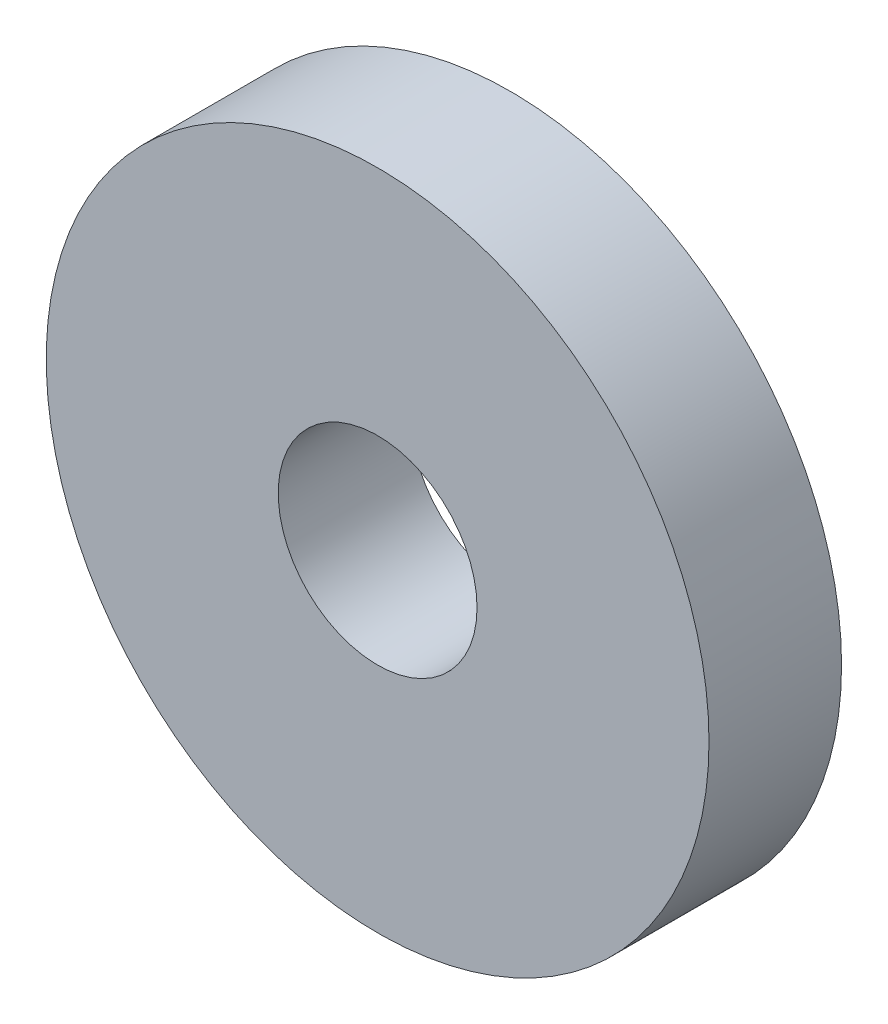
ISO-10303-21;
HEADER;
FILE_DESCRIPTION(('STEP AP214'),'2;1');
FILE_NAME('part.step','',(''),(''),'','','');
FILE_SCHEMA(('AUTOMOTIVE_DESIGN { 1 0 10303 214 1 1 1 1 }'));
ENDSEC;
DATA;
#1=APPLICATION_CONTEXT('core data for automotive mechanical design processes');
#2=APPLICATION_PROTOCOL_DEFINITION('international standard','automotive_design',2000,#1);
#3=PRODUCT_CONTEXT('',#1,'mechanical');
#4=PRODUCT('Part','Part','',(#3));
#5=PRODUCT_RELATED_PRODUCT_CATEGORY('part','',(#4));
#6=PRODUCT_DEFINITION_FORMATION('','',#4);
#7=PRODUCT_DEFINITION_CONTEXT('part definition',#1,'design');
#8=PRODUCT_DEFINITION('design','',#6,#7);
#9=PRODUCT_DEFINITION_SHAPE('','',#8);
#10=(LENGTH_UNIT() NAMED_UNIT(*) SI_UNIT(.MILLI.,.METRE.));
#11=(NAMED_UNIT(*) PLANE_ANGLE_UNIT() SI_UNIT($,.RADIAN.));
#12=(NAMED_UNIT(*) SI_UNIT($,.STERADIAN.) SOLID_ANGLE_UNIT());
#13=UNCERTAINTY_MEASURE_WITH_UNIT(LENGTH_MEASURE(1.E-05),#10,'distance_accuracy_value','');
#14=(GEOMETRIC_REPRESENTATION_CONTEXT(3) GLOBAL_UNCERTAINTY_ASSIGNED_CONTEXT((#13)) GLOBAL_UNIT_ASSIGNED_CONTEXT((#10,
#11,#12)) REPRESENTATION_CONTEXT('',''));
#15=CARTESIAN_POINT('',(0.,0.,0.));
#16=DIRECTION('',(0.,0.,1.));
#17=DIRECTION('',(1.,0.,0.));
#18=AXIS2_PLACEMENT_3D('',#15,#16,#17);
#19=CARTESIAN_POINT('',(0.,0.,3.));
#20=DIRECTION('',(0.,0.,1.));
#21=DIRECTION('',(1.,0.,0.));
#22=AXIS2_PLACEMENT_3D('',#19,#20,#21);
#23=PLANE('',#22);
#24=CARTESIAN_POINT('',(0.,0.,3.));
#25=DIRECTION('',(0.,0.,1.));
#26=DIRECTION('',(1.,0.,0.));
#27=AXIS2_PLACEMENT_3D('',#24,#25,#26);
#28=CIRCLE('',#27,7.5);
#29=CARTESIAN_POINT('',(7.5,0.,3.));
#30=VERTEX_POINT('',#29);
#31=EDGE_CURVE('E10',#30,#30,#28,.T.);
#32=ORIENTED_EDGE('',*,*,#31,.T.);
#33=EDGE_LOOP('',(#32));
#34=FACE_BOUND('',#33,.T.);
#35=CARTESIAN_POINT('',(0.,0.,3.));
#36=DIRECTION('',(0.,0.,1.));
#37=DIRECTION('',(1.,0.,0.));
#38=AXIS2_PLACEMENT_3D('',#35,#36,#37);
#39=CIRCLE('',#38,2.25);
#40=CARTESIAN_POINT('',(2.25,0.,3.));
#41=VERTEX_POINT('',#40);
#42=EDGE_CURVE('E42',#41,#41,#39,.T.);
#43=ORIENTED_EDGE('',*,*,#42,.F.);
#44=EDGE_LOOP('',(#43));
#45=FACE_BOUND('',#44,.T.);
#46=ADVANCED_FACE('F31',(#34,#45),#23,.T.);
#47=CARTESIAN_POINT('',(0.,0.,0.));
#48=DIRECTION('',(0.,0.,1.));
#49=DIRECTION('',(1.,0.,0.));
#50=AXIS2_PLACEMENT_3D('',#47,#48,#49);
#51=PLANE('',#50);
#52=CARTESIAN_POINT('',(0.,0.,0.));
#53=DIRECTION('',(0.,0.,1.));
#54=DIRECTION('',(1.,0.,0.));
#55=AXIS2_PLACEMENT_3D('',#52,#53,#54);
#56=CIRCLE('',#55,7.5);
#57=CARTESIAN_POINT('',(7.5,0.,0.));
#58=VERTEX_POINT('',#57);
#59=EDGE_CURVE('E35',#58,#58,#56,.T.);
#60=ORIENTED_EDGE('',*,*,#59,.F.);
#61=EDGE_LOOP('',(#60));
#62=FACE_BOUND('',#61,.T.);
#63=CARTESIAN_POINT('',(0.,0.,0.));
#64=DIRECTION('',(0.,0.,1.));
#65=DIRECTION('',(1.,0.,0.));
#66=AXIS2_PLACEMENT_3D('',#63,#64,#65);
#67=CIRCLE('',#66,2.25);
#68=CARTESIAN_POINT('',(2.25,0.,0.));
#69=VERTEX_POINT('',#68);
#70=EDGE_CURVE('E44',#69,#69,#67,.T.);
#71=ORIENTED_EDGE('',*,*,#70,.T.);
#72=EDGE_LOOP('',(#71));
#73=FACE_BOUND('',#72,.T.);
#74=ADVANCED_FACE('F54',(#62,#73),#51,.F.);
#75=CARTESIAN_POINT('',(0.,0.,3.));
#76=DIRECTION('',(0.,0.,-1.));
#77=DIRECTION('',(-1.,0.,0.));
#78=AXIS2_PLACEMENT_3D('',#75,#76,#77);
#79=CYLINDRICAL_SURFACE('',#78,7.5);
#80=ORIENTED_EDGE('',*,*,#31,.F.);
#81=EDGE_LOOP('',(#80));
#82=FACE_BOUND('',#81,.T.);
#83=ORIENTED_EDGE('',*,*,#59,.T.);
#84=EDGE_LOOP('',(#83));
#85=FACE_BOUND('',#84,.T.);
#86=ADVANCED_FACE('F33',(#82,#85),#79,.T.);
#87=CARTESIAN_POINT('',(0.,0.,3.));
#88=DIRECTION('',(0.,0.,-1.));
#89=DIRECTION('',(-1.,0.,0.));
#90=AXIS2_PLACEMENT_3D('',#87,#88,#89);
#91=CYLINDRICAL_SURFACE('',#90,2.25);
#92=ORIENTED_EDGE('',*,*,#42,.T.);
#93=EDGE_LOOP('',(#92));
#94=FACE_BOUND('',#93,.T.);
#95=ORIENTED_EDGE('',*,*,#70,.F.);
#96=EDGE_LOOP('',(#95));
#97=FACE_BOUND('',#96,.T.);
#98=ADVANCED_FACE('F50',(#94,#97),#91,.F.);
#99=CLOSED_SHELL('',(#46,#74,#86,#98));
#100=MANIFOLD_SOLID_BREP('B2',#99);
#101=ADVANCED_BREP_SHAPE_REPRESENTATION('',(#18,#100),#14);
#102=SHAPE_DEFINITION_REPRESENTATION(#9,#101);
ENDSEC;
END-ISO-10303-21;
